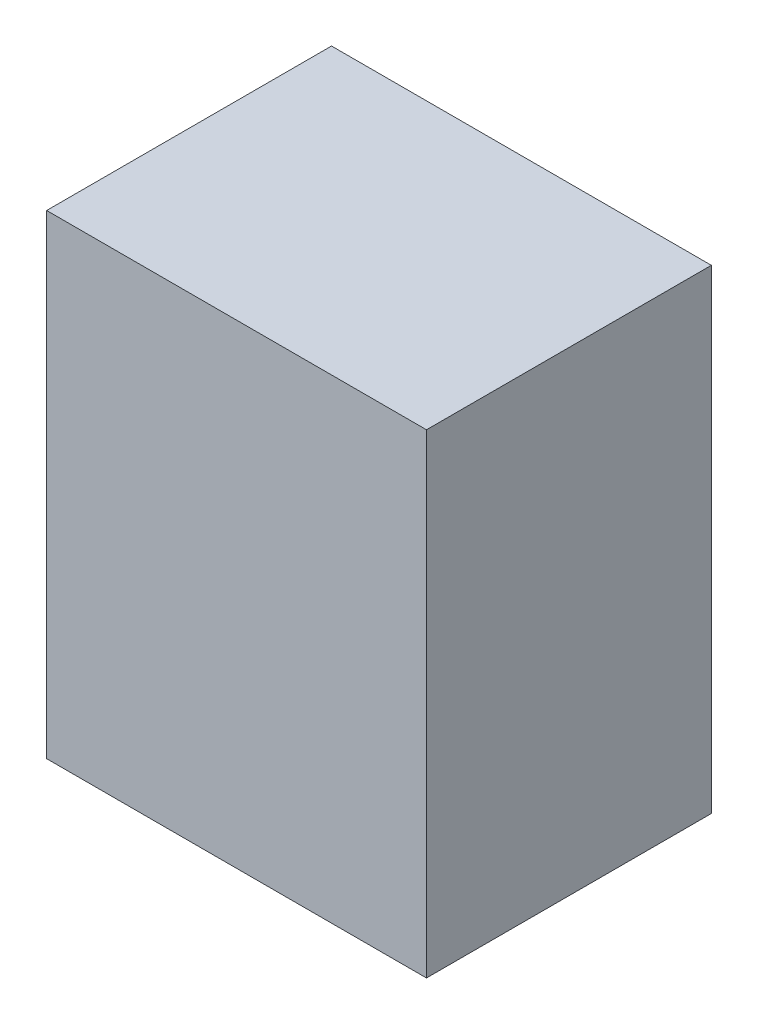
ISO-10303-21;
HEADER;
FILE_DESCRIPTION(('STEP AP214'),'2;1');
FILE_NAME('part.step','',(''),(''),'','','');
FILE_SCHEMA(('AUTOMOTIVE_DESIGN { 1 0 10303 214 1 1 1 1 }'));
ENDSEC;
DATA;
#1=APPLICATION_CONTEXT('core data for automotive mechanical design processes');
#2=APPLICATION_PROTOCOL_DEFINITION('international standard','automotive_design',2000,#1);
#3=PRODUCT_CONTEXT('',#1,'mechanical');
#4=PRODUCT('Part','Part','',(#3));
#5=PRODUCT_RELATED_PRODUCT_CATEGORY('part','',(#4));
#6=PRODUCT_DEFINITION_FORMATION('','',#4);
#7=PRODUCT_DEFINITION_CONTEXT('part definition',#1,'design');
#8=PRODUCT_DEFINITION('design','',#6,#7);
#9=PRODUCT_DEFINITION_SHAPE('','',#8);
#10=(LENGTH_UNIT() NAMED_UNIT(*) SI_UNIT(.MILLI.,.METRE.));
#11=(NAMED_UNIT(*) PLANE_ANGLE_UNIT() SI_UNIT($,.RADIAN.));
#12=(NAMED_UNIT(*) SI_UNIT($,.STERADIAN.) SOLID_ANGLE_UNIT());
#13=UNCERTAINTY_MEASURE_WITH_UNIT(LENGTH_MEASURE(1.E-05),#10,'distance_accuracy_value','');
#14=(GEOMETRIC_REPRESENTATION_CONTEXT(3) GLOBAL_UNCERTAINTY_ASSIGNED_CONTEXT((#13)) GLOBAL_UNIT_ASSIGNED_CONTEXT((#10,
#11,#12)) REPRESENTATION_CONTEXT('',''));
#15=CARTESIAN_POINT('',(0.,0.,0.));
#16=DIRECTION('',(0.,0.,1.));
#17=DIRECTION('',(1.,0.,0.));
#18=AXIS2_PLACEMENT_3D('',#15,#16,#17);
#19=CARTESIAN_POINT('',(20.,25.,30.));
#20=DIRECTION('',(-1.,0.,0.));
#21=DIRECTION('',(0.,-1.,0.));
#22=AXIS2_PLACEMENT_3D('',#19,#20,#21);
#23=PLANE('',#22);
#24=DIRECTION('',(0.,1.,0.));
#25=VECTOR('',#24,1.);
#26=CARTESIAN_POINT('',(20.,25.,0.));
#27=LINE('',#26,#25);
#28=CARTESIAN_POINT('',(20.,-25.,0.));
#29=VERTEX_POINT('',#28);
#30=CARTESIAN_POINT('',(20.,25.,0.));
#31=VERTEX_POINT('',#30);
#32=EDGE_CURVE('E97',#29,#31,#27,.T.);
#33=ORIENTED_EDGE('',*,*,#32,.T.);
#34=DIRECTION('',(0.,0.,-1.));
#35=VECTOR('',#34,1.);
#36=CARTESIAN_POINT('',(20.,25.,30.));
#37=LINE('',#36,#35);
#38=CARTESIAN_POINT('',(20.,25.,30.));
#39=VERTEX_POINT('',#38);
#40=EDGE_CURVE('E11',#39,#31,#37,.T.);
#41=ORIENTED_EDGE('',*,*,#40,.F.);
#42=DIRECTION('',(0.,1.,0.));
#43=VECTOR('',#42,1.);
#44=CARTESIAN_POINT('',(20.,25.,30.));
#45=LINE('',#44,#43);
#46=CARTESIAN_POINT('',(20.,-25.,30.));
#47=VERTEX_POINT('',#46);
#48=EDGE_CURVE('E85',#47,#39,#45,.T.);
#49=ORIENTED_EDGE('',*,*,#48,.F.);
#50=DIRECTION('',(0.,0.,-1.));
#51=VECTOR('',#50,1.);
#52=CARTESIAN_POINT('',(20.,-25.,30.));
#53=LINE('',#52,#51);
#54=EDGE_CURVE('E93',#47,#29,#53,.T.);
#55=ORIENTED_EDGE('',*,*,#54,.T.);
#56=EDGE_LOOP('',(#33,#41,#49,#55));
#57=FACE_BOUND('',#56,.T.);
#58=ADVANCED_FACE('F34',(#57),#23,.F.);
#59=CARTESIAN_POINT('',(-20.,25.,30.));
#60=DIRECTION('',(0.,-1.,0.));
#61=DIRECTION('',(0.,0.,-1.));
#62=AXIS2_PLACEMENT_3D('',#59,#60,#61);
#63=PLANE('',#62);
#64=DIRECTION('',(-1.,0.,0.));
#65=VECTOR('',#64,1.);
#66=CARTESIAN_POINT('',(-20.,25.,0.));
#67=LINE('',#66,#65);
#68=CARTESIAN_POINT('',(-20.,25.,0.));
#69=VERTEX_POINT('',#68);
#70=EDGE_CURVE('E89',#31,#69,#67,.T.);
#71=ORIENTED_EDGE('',*,*,#70,.T.);
#72=DIRECTION('',(0.,0.,-1.));
#73=VECTOR('',#72,1.);
#74=CARTESIAN_POINT('',(-20.,25.,30.));
#75=LINE('',#74,#73);
#76=CARTESIAN_POINT('',(-20.,25.,30.));
#77=VERTEX_POINT('',#76);
#78=EDGE_CURVE('E42',#77,#69,#75,.T.);
#79=ORIENTED_EDGE('',*,*,#78,.F.);
#80=DIRECTION('',(-1.,0.,0.));
#81=VECTOR('',#80,1.);
#82=CARTESIAN_POINT('',(-20.,25.,30.));
#83=LINE('',#82,#81);
#84=EDGE_CURVE('E80',#39,#77,#83,.T.);
#85=ORIENTED_EDGE('',*,*,#84,.F.);
#86=ORIENTED_EDGE('',*,*,#40,.T.);
#87=EDGE_LOOP('',(#71,#79,#85,#86));
#88=FACE_BOUND('',#87,.T.);
#89=ADVANCED_FACE('F88',(#88),#63,.F.);
#90=CARTESIAN_POINT('',(-20.,25.,30.));
#91=DIRECTION('',(1.,0.,0.));
#92=DIRECTION('',(0.,1.,0.));
#93=AXIS2_PLACEMENT_3D('',#90,#91,#92);
#94=PLANE('',#93);
#95=DIRECTION('',(0.,-1.,0.));
#96=VECTOR('',#95,1.);
#97=CARTESIAN_POINT('',(-20.,25.,0.));
#98=LINE('',#97,#96);
#99=CARTESIAN_POINT('',(-20.,-25.,0.));
#100=VERTEX_POINT('',#99);
#101=EDGE_CURVE('E67',#69,#100,#98,.T.);
#102=ORIENTED_EDGE('',*,*,#101,.T.);
#103=DIRECTION('',(0.,0.,-1.));
#104=VECTOR('',#103,1.);
#105=CARTESIAN_POINT('',(-20.,-25.,30.));
#106=LINE('',#105,#104);
#107=CARTESIAN_POINT('',(-20.,-25.,30.));
#108=VERTEX_POINT('',#107);
#109=EDGE_CURVE('E90',#108,#100,#106,.T.);
#110=ORIENTED_EDGE('',*,*,#109,.F.);
#111=DIRECTION('',(0.,-1.,0.));
#112=VECTOR('',#111,1.);
#113=CARTESIAN_POINT('',(-20.,25.,30.));
#114=LINE('',#113,#112);
#115=EDGE_CURVE('E83',#77,#108,#114,.T.);
#116=ORIENTED_EDGE('',*,*,#115,.F.);
#117=ORIENTED_EDGE('',*,*,#78,.T.);
#118=EDGE_LOOP('',(#102,#110,#116,#117));
#119=FACE_BOUND('',#118,.T.);
#120=ADVANCED_FACE('F91',(#119),#94,.F.);
#121=CARTESIAN_POINT('',(-20.,-25.,30.));
#122=DIRECTION('',(0.,1.,0.));
#123=DIRECTION('',(0.,0.,1.));
#124=AXIS2_PLACEMENT_3D('',#121,#122,#123);
#125=PLANE('',#124);
#126=DIRECTION('',(1.,0.,0.));
#127=VECTOR('',#126,1.);
#128=CARTESIAN_POINT('',(-20.,-25.,0.));
#129=LINE('',#128,#127);
#130=EDGE_CURVE('E73',#100,#29,#129,.T.);
#131=ORIENTED_EDGE('',*,*,#130,.T.);
#132=ORIENTED_EDGE('',*,*,#54,.F.);
#133=DIRECTION('',(1.,0.,0.));
#134=VECTOR('',#133,1.);
#135=CARTESIAN_POINT('',(-20.,-25.,30.));
#136=LINE('',#135,#134);
#137=EDGE_CURVE('E50',#108,#47,#136,.T.);
#138=ORIENTED_EDGE('',*,*,#137,.F.);
#139=ORIENTED_EDGE('',*,*,#109,.T.);
#140=EDGE_LOOP('',(#131,#132,#138,#139));
#141=FACE_BOUND('',#140,.T.);
#142=ADVANCED_FACE('F104',(#141),#125,.F.);
#143=CARTESIAN_POINT('',(0.,0.,30.));
#144=DIRECTION('',(0.,0.,1.));
#145=DIRECTION('',(1.,0.,0.));
#146=AXIS2_PLACEMENT_3D('',#143,#144,#145);
#147=PLANE('',#146);
#148=ORIENTED_EDGE('',*,*,#48,.T.);
#149=ORIENTED_EDGE('',*,*,#84,.T.);
#150=ORIENTED_EDGE('',*,*,#115,.T.);
#151=ORIENTED_EDGE('',*,*,#137,.T.);
#152=EDGE_LOOP('',(#148,#149,#150,#151));
#153=FACE_BOUND('',#152,.T.);
#154=ADVANCED_FACE('F81',(#153),#147,.T.);
#155=CARTESIAN_POINT('',(0.,0.,0.));
#156=DIRECTION('',(0.,0.,1.));
#157=DIRECTION('',(1.,0.,0.));
#158=AXIS2_PLACEMENT_3D('',#155,#156,#157);
#159=PLANE('',#158);
#160=ORIENTED_EDGE('',*,*,#32,.F.);
#161=ORIENTED_EDGE('',*,*,#130,.F.);
#162=ORIENTED_EDGE('',*,*,#101,.F.);
#163=ORIENTED_EDGE('',*,*,#70,.F.);
#164=EDGE_LOOP('',(#160,#161,#162,#163));
#165=FACE_BOUND('',#164,.T.);
#166=ADVANCED_FACE('F107',(#165),#159,.F.);
#167=CLOSED_SHELL('',(#58,#89,#120,#142,#154,#166));
#168=MANIFOLD_SOLID_BREP('B2',#167);
#169=ADVANCED_BREP_SHAPE_REPRESENTATION('',(#18,#168),#14);
#170=SHAPE_DEFINITION_REPRESENTATION(#9,#169);
ENDSEC;
END-ISO-10303-21;
